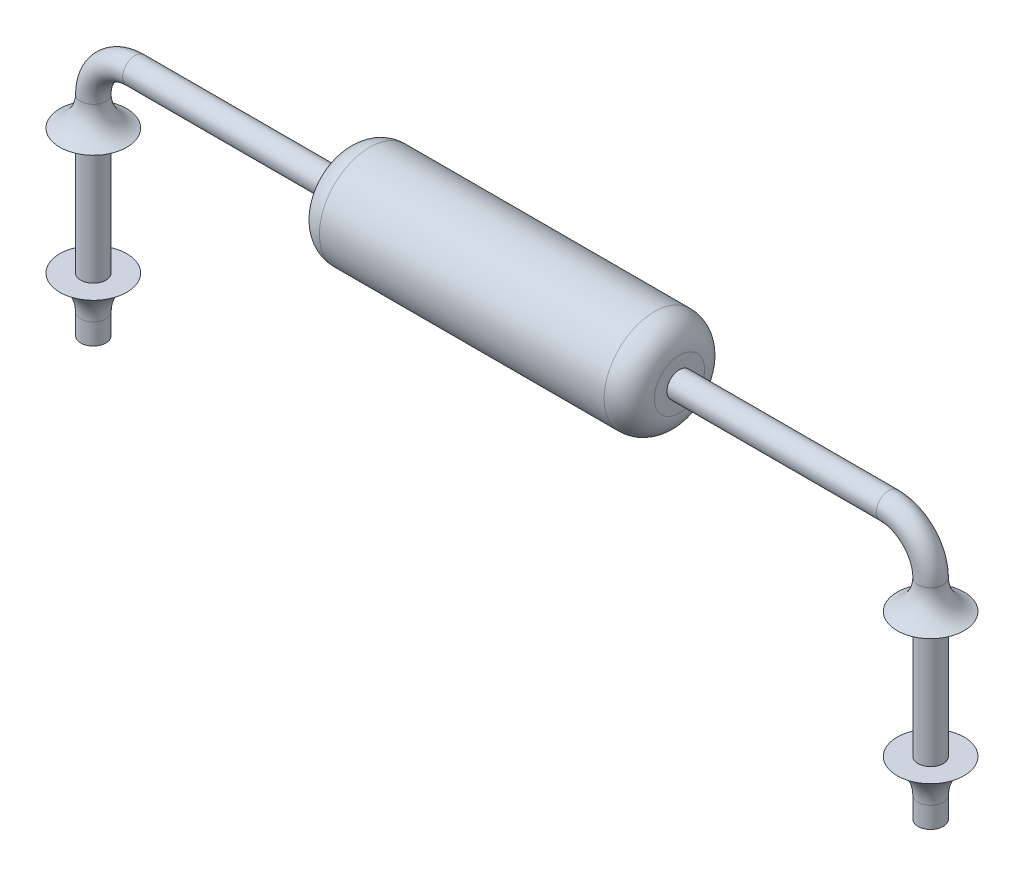
ISO-10303-21;
HEADER;
FILE_DESCRIPTION(('STEP AP214'),'2;1');
FILE_NAME('part.step','',(''),(''),'','','');
FILE_SCHEMA(('AUTOMOTIVE_DESIGN { 1 0 10303 214 1 1 1 1 }'));
ENDSEC;
DATA;
#1=APPLICATION_CONTEXT('core data for automotive mechanical design processes');
#2=APPLICATION_PROTOCOL_DEFINITION('international standard','automotive_design',2000,#1);
#3=PRODUCT_CONTEXT('',#1,'mechanical');
#4=PRODUCT('Part','Part','',(#3));
#5=PRODUCT_RELATED_PRODUCT_CATEGORY('part','',(#4));
#6=PRODUCT_DEFINITION_FORMATION('','',#4);
#7=PRODUCT_DEFINITION_CONTEXT('part definition',#1,'design');
#8=PRODUCT_DEFINITION('design','',#6,#7);
#9=PRODUCT_DEFINITION_SHAPE('','',#8);
#10=(LENGTH_UNIT() NAMED_UNIT(*) SI_UNIT(.MILLI.,.METRE.));
#11=(NAMED_UNIT(*) PLANE_ANGLE_UNIT() SI_UNIT($,.RADIAN.));
#12=(NAMED_UNIT(*) SI_UNIT($,.STERADIAN.) SOLID_ANGLE_UNIT());
#13=UNCERTAINTY_MEASURE_WITH_UNIT(LENGTH_MEASURE(1.E-05),#10,'distance_accuracy_value','');
#14=(GEOMETRIC_REPRESENTATION_CONTEXT(3) GLOBAL_UNCERTAINTY_ASSIGNED_CONTEXT((#13)) GLOBAL_UNIT_ASSIGNED_CONTEXT((#10,
#11,#12)) REPRESENTATION_CONTEXT('',''));
#15=CARTESIAN_POINT('',(0.,0.,0.));
#16=DIRECTION('',(0.,0.,1.));
#17=DIRECTION('',(1.,0.,0.));
#18=AXIS2_PLACEMENT_3D('',#15,#16,#17);
#19=CARTESIAN_POINT('',(5.,-0.5,0.));
#20=DIRECTION('',(0.,-1.,0.));
#21=DIRECTION('',(1.,0.,0.));
#22=AXIS2_PLACEMENT_3D('',#19,#20,#21);
#23=CYLINDRICAL_SURFACE('',#22,0.15);
#24=CARTESIAN_POINT('',(5.,-0.850000000000001,0.));
#25=DIRECTION('',(0.,1.,0.));
#26=DIRECTION('',(-1.,0.,0.));
#27=AXIS2_PLACEMENT_3D('',#24,#25,#26);
#28=CIRCLE('',#27,0.15);
#29=CARTESIAN_POINT('',(4.85,-0.850000000000001,0.));
#30=VERTEX_POINT('',#29);
#31=EDGE_CURVE('E45',#30,#30,#28,.T.);
#32=ORIENTED_EDGE('',*,*,#31,.F.);
#33=EDGE_LOOP('',(#32));
#34=FACE_BOUND('',#33,.T.);
#35=CARTESIAN_POINT('',(5.,-2.35,0.));
#36=DIRECTION('',(0.,-1.,0.));
#37=DIRECTION('',(1.,0.,0.));
#38=AXIS2_PLACEMENT_3D('',#35,#36,#37);
#39=CIRCLE('',#38,0.15);
#40=CARTESIAN_POINT('',(5.15,-2.35,0.));
#41=VERTEX_POINT('',#40);
#42=EDGE_CURVE('E41',#41,#41,#39,.T.);
#43=ORIENTED_EDGE('',*,*,#42,.F.);
#44=EDGE_LOOP('',(#43));
#45=FACE_BOUND('',#44,.T.);
#46=ADVANCED_FACE('F33',(#34,#45),#23,.T.);
#47=CARTESIAN_POINT('',(-2.,0.3,0.));
#48=DIRECTION('',(-1.,0.,0.));
#49=DIRECTION('',(0.,-1.,0.));
#50=AXIS2_PLACEMENT_3D('',#47,#48,#49);
#51=PLANE('',#50);
#52=CARTESIAN_POINT('',(-2.,0.,0.));
#53=DIRECTION('',(1.,0.,0.));
#54=DIRECTION('',(0.,1.,0.));
#55=AXIS2_PLACEMENT_3D('',#52,#53,#54);
#56=CIRCLE('',#55,0.3);
#57=CARTESIAN_POINT('',(-2.,0.3,0.));
#58=VERTEX_POINT('',#57);
#59=EDGE_CURVE('E134',#58,#58,#56,.T.);
#60=ORIENTED_EDGE('',*,*,#59,.F.);
#61=EDGE_LOOP('',(#60));
#62=FACE_BOUND('',#61,.T.);
#63=CARTESIAN_POINT('',(-2.,0.,0.));
#64=DIRECTION('',(-1.,0.,0.));
#65=DIRECTION('',(0.,-1.,0.));
#66=AXIS2_PLACEMENT_3D('',#63,#64,#65);
#67=CIRCLE('',#66,0.15);
#68=CARTESIAN_POINT('',(-2.,-0.150000000000002,0.));
#69=VERTEX_POINT('',#68);
#70=EDGE_CURVE('E60',#69,#69,#67,.T.);
#71=ORIENTED_EDGE('',*,*,#70,.F.);
#72=EDGE_LOOP('',(#71));
#73=FACE_BOUND('',#72,.T.);
#74=ADVANCED_FACE('F173',(#62,#73),#51,.T.);
#75=CARTESIAN_POINT('',(2.,0.3,0.));
#76=DIRECTION('',(1.,0.,0.));
#77=DIRECTION('',(0.,1.,0.));
#78=AXIS2_PLACEMENT_3D('',#75,#76,#77);
#79=PLANE('',#78);
#80=CARTESIAN_POINT('',(2.,0.,0.));
#81=DIRECTION('',(1.,0.,0.));
#82=DIRECTION('',(0.,1.,0.));
#83=AXIS2_PLACEMENT_3D('',#80,#81,#82);
#84=CIRCLE('',#83,0.3);
#85=CARTESIAN_POINT('',(2.,0.3,0.));
#86=VERTEX_POINT('',#85);
#87=EDGE_CURVE('E119',#86,#86,#84,.T.);
#88=ORIENTED_EDGE('',*,*,#87,.T.);
#89=EDGE_LOOP('',(#88));
#90=FACE_BOUND('',#89,.T.);
#91=CARTESIAN_POINT('',(2.,0.,0.));
#92=DIRECTION('',(1.,0.,0.));
#93=DIRECTION('',(0.,1.,0.));
#94=AXIS2_PLACEMENT_3D('',#91,#92,#93);
#95=CIRCLE('',#94,0.15);
#96=CARTESIAN_POINT('',(2.,0.149999999999998,0.));
#97=VERTEX_POINT('',#96);
#98=EDGE_CURVE('E67',#97,#97,#95,.T.);
#99=ORIENTED_EDGE('',*,*,#98,.F.);
#100=EDGE_LOOP('',(#99));
#101=FACE_BOUND('',#100,.T.);
#102=ADVANCED_FACE('F180',(#90,#101),#79,.T.);
#103=CARTESIAN_POINT('',(-1.7,0.,0.));
#104=DIRECTION('',(1.,0.,0.));
#105=DIRECTION('',(0.,1.,0.));
#106=AXIS2_PLACEMENT_3D('',#103,#104,#105);
#107=TOROIDAL_SURFACE('',#106,0.3,0.3);
#108=ORIENTED_EDGE('',*,*,#59,.T.);
#109=EDGE_LOOP('',(#108));
#110=FACE_BOUND('',#109,.T.);
#111=CARTESIAN_POINT('',(-1.7,0.,0.));
#112=DIRECTION('',(1.,0.,0.));
#113=DIRECTION('',(0.,1.,0.));
#114=AXIS2_PLACEMENT_3D('',#111,#112,#113);
#115=CIRCLE('',#114,0.6);
#116=CARTESIAN_POINT('',(-1.7,0.6,0.));
#117=VERTEX_POINT('',#116);
#118=EDGE_CURVE('E73',#117,#117,#115,.T.);
#119=ORIENTED_EDGE('',*,*,#118,.F.);
#120=EDGE_LOOP('',(#119));
#121=FACE_BOUND('',#120,.T.);
#122=ADVANCED_FACE('F333',(#110,#121),#107,.T.);
#123=CARTESIAN_POINT('',(2.,0.,0.));
#124=DIRECTION('',(1.,0.,0.));
#125=DIRECTION('',(0.,1.,0.));
#126=AXIS2_PLACEMENT_3D('',#123,#124,#125);
#127=CYLINDRICAL_SURFACE('',#126,0.6);
#128=ORIENTED_EDGE('',*,*,#118,.T.);
#129=EDGE_LOOP('',(#128));
#130=FACE_BOUND('',#129,.T.);
#131=CARTESIAN_POINT('',(1.7,0.,0.));
#132=DIRECTION('',(1.,0.,0.));
#133=DIRECTION('',(0.,1.,0.));
#134=AXIS2_PLACEMENT_3D('',#131,#132,#133);
#135=CIRCLE('',#134,0.6);
#136=CARTESIAN_POINT('',(1.7,0.6,0.));
#137=VERTEX_POINT('',#136);
#138=EDGE_CURVE('E116',#137,#137,#135,.T.);
#139=ORIENTED_EDGE('',*,*,#138,.F.);
#140=EDGE_LOOP('',(#139));
#141=FACE_BOUND('',#140,.T.);
#142=ADVANCED_FACE('F343',(#130,#141),#127,.T.);
#143=CARTESIAN_POINT('',(1.7,0.,0.));
#144=DIRECTION('',(1.,0.,0.));
#145=DIRECTION('',(0.,1.,0.));
#146=AXIS2_PLACEMENT_3D('',#143,#144,#145);
#147=DEGENERATE_TOROIDAL_SURFACE('',#146,0.3,0.3,.T.);
#148=ORIENTED_EDGE('',*,*,#138,.T.);
#149=EDGE_LOOP('',(#148));
#150=FACE_BOUND('',#149,.T.);
#151=ORIENTED_EDGE('',*,*,#87,.F.);
#152=EDGE_LOOP('',(#151));
#153=FACE_BOUND('',#152,.T.);
#154=ADVANCED_FACE('F246',(#150,#153),#147,.T.);
#155=CARTESIAN_POINT('',(-4.5,-0.5,0.));
#156=DIRECTION('',(0.,0.,-1.));
#157=DIRECTION('',(-1.,0.,0.));
#158=AXIS2_PLACEMENT_3D('',#155,#156,#157);
#159=TOROIDAL_SURFACE('',#158,0.499999999999998,0.15);
#160=CARTESIAN_POINT('',(-5.,-0.499999999999999,0.));
#161=DIRECTION('',(0.,-1.,0.));
#162=DIRECTION('',(0.,0.,-1.));
#163=AXIS2_PLACEMENT_3D('',#160,#161,#162);
#164=CIRCLE('',#163,0.15);
#165=CARTESIAN_POINT('',(-5.15,-0.499999999999999,0.));
#166=VERTEX_POINT('',#165);
#167=EDGE_CURVE('E63',#166,#166,#164,.T.);
#168=CARTESIAN_POINT('',(-4.5,0.,0.));
#169=DIRECTION('',(-1.,0.,0.));
#170=DIRECTION('',(0.,0.,-1.));
#171=AXIS2_PLACEMENT_3D('',#168,#169,#170);
#172=CIRCLE('',#171,0.15);
#173=CARTESIAN_POINT('',(-4.5,0.149999999999998,0.));
#174=VERTEX_POINT('',#173);
#175=EDGE_CURVE('E109',#174,#174,#172,.T.);
#176=CARTESIAN_POINT('',(-4.5,-0.5,0.));
#177=DIRECTION('',(0.,0.,-1.));
#178=DIRECTION('',(-1.,0.,0.));
#179=AXIS2_PLACEMENT_3D('',#176,#177,#178);
#180=CIRCLE('',#179,0.649999999999998);
#181=EDGE_CURVE('',#166,#174,#180,.T.);
#182=ORIENTED_EDGE('',*,*,#167,.F.);
#183=ORIENTED_EDGE('',*,*,#175,.T.);
#184=ORIENTED_EDGE('',*,*,#181,.T.);
#185=ORIENTED_EDGE('',*,*,#181,.F.);
#186=EDGE_LOOP('',(#182,#184,#183,#185));
#187=FACE_BOUND('',#186,.T.);
#188=ADVANCED_FACE('F242',(#187),#159,.T.);
#189=CARTESIAN_POINT('',(-4.5,0.,0.));
#190=DIRECTION('',(1.,0.,0.));
#191=DIRECTION('',(0.,1.,0.));
#192=AXIS2_PLACEMENT_3D('',#189,#190,#191);
#193=CYLINDRICAL_SURFACE('',#192,0.15);
#194=ORIENTED_EDGE('',*,*,#70,.T.);
#195=EDGE_LOOP('',(#194));
#196=FACE_BOUND('',#195,.T.);
#197=ORIENTED_EDGE('',*,*,#175,.F.);
#198=EDGE_LOOP('',(#197));
#199=FACE_BOUND('',#198,.T.);
#200=ADVANCED_FACE('F245',(#196,#199),#193,.T.);
#201=CARTESIAN_POINT('',(4.5,-0.5,0.));
#202=DIRECTION('',(0.,0.,-1.));
#203=DIRECTION('',(-1.,0.,0.));
#204=AXIS2_PLACEMENT_3D('',#201,#202,#203);
#205=TOROIDAL_SURFACE('',#204,0.499999999999997,0.15);
#206=CARTESIAN_POINT('',(4.5,0.,0.));
#207=DIRECTION('',(-1.,0.,0.));
#208=DIRECTION('',(0.,0.,-1.));
#209=AXIS2_PLACEMENT_3D('',#206,#207,#208);
#210=CIRCLE('',#209,0.15);
#211=CARTESIAN_POINT('',(4.5,0.149999999999998,0.));
#212=VERTEX_POINT('',#211);
#213=EDGE_CURVE('E106',#212,#212,#210,.T.);
#214=CARTESIAN_POINT('',(5.,-0.5,0.));
#215=DIRECTION('',(0.,1.,0.));
#216=DIRECTION('',(0.,0.,-1.));
#217=AXIS2_PLACEMENT_3D('',#214,#215,#216);
#218=CIRCLE('',#217,0.15);
#219=CARTESIAN_POINT('',(5.15,-0.500000000000001,0.));
#220=VERTEX_POINT('',#219);
#221=EDGE_CURVE('E101',#220,#220,#218,.T.);
#222=CARTESIAN_POINT('',(4.5,-0.5,0.));
#223=DIRECTION('',(0.,0.,-1.));
#224=DIRECTION('',(-1.,0.,0.));
#225=AXIS2_PLACEMENT_3D('',#222,#223,#224);
#226=CIRCLE('',#225,0.649999999999997);
#227=EDGE_CURVE('',#212,#220,#226,.T.);
#228=ORIENTED_EDGE('',*,*,#213,.F.);
#229=ORIENTED_EDGE('',*,*,#221,.T.);
#230=ORIENTED_EDGE('',*,*,#227,.T.);
#231=ORIENTED_EDGE('',*,*,#227,.F.);
#232=EDGE_LOOP('',(#228,#230,#229,#231));
#233=FACE_BOUND('',#232,.T.);
#234=ADVANCED_FACE('F251',(#233),#205,.T.);
#235=ORIENTED_EDGE('',*,*,#98,.T.);
#236=EDGE_LOOP('',(#235));
#237=FACE_BOUND('',#236,.T.);
#238=ORIENTED_EDGE('',*,*,#213,.T.);
#239=EDGE_LOOP('',(#238));
#240=FACE_BOUND('',#239,.T.);
#241=ADVANCED_FACE('F239',(#237,#240),#193,.T.);
#242=CARTESIAN_POINT('',(-5.,-0.499999999999999,0.));
#243=DIRECTION('',(0.,1.,0.));
#244=DIRECTION('',(0.,0.,1.));
#245=AXIS2_PLACEMENT_3D('',#242,#243,#244);
#246=TOROIDAL_SURFACE('',#245,0.520000000000002,0.370000000000002);
#247=CARTESIAN_POINT('',(-5.,-0.850000000000001,0.));
#248=DIRECTION('',(0.,1.,0.));
#249=DIRECTION('',(0.,0.,1.));
#250=AXIS2_PLACEMENT_3D('',#247,#248,#249);
#251=CIRCLE('',#250,0.4);
#252=CARTESIAN_POINT('',(-5.,-0.850000000000001,0.4));
#253=VERTEX_POINT('',#252);
#254=EDGE_CURVE('E59',#253,#253,#251,.T.);
#255=ORIENTED_EDGE('',*,*,#254,.T.);
#256=EDGE_LOOP('',(#255));
#257=FACE_BOUND('',#256,.T.);
#258=ORIENTED_EDGE('',*,*,#167,.T.);
#259=EDGE_LOOP('',(#258));
#260=FACE_BOUND('',#259,.T.);
#261=ADVANCED_FACE('F233',(#257,#260),#246,.F.);
#262=CARTESIAN_POINT('',(-5.15,-0.85,0.));
#263=DIRECTION('',(0.,-1.,0.));
#264=DIRECTION('',(0.,0.,-1.));
#265=AXIS2_PLACEMENT_3D('',#262,#263,#264);
#266=PLANE('',#265);
#267=CARTESIAN_POINT('',(-5.,-0.85,0.));
#268=DIRECTION('',(0.,1.,0.));
#269=DIRECTION('',(0.,0.,1.));
#270=AXIS2_PLACEMENT_3D('',#267,#268,#269);
#271=CIRCLE('',#270,0.15);
#272=CARTESIAN_POINT('',(-5.,-0.85,0.15));
#273=VERTEX_POINT('',#272);
#274=EDGE_CURVE('E141',#273,#273,#271,.T.);
#275=ORIENTED_EDGE('',*,*,#274,.T.);
#276=EDGE_LOOP('',(#275));
#277=FACE_BOUND('',#276,.T.);
#278=ORIENTED_EDGE('',*,*,#254,.F.);
#279=EDGE_LOOP('',(#278));
#280=FACE_BOUND('',#279,.T.);
#281=ADVANCED_FACE('F228',(#277,#280),#266,.T.);
#282=CARTESIAN_POINT('',(-5.,-6.5,0.));
#283=DIRECTION('',(0.,1.,0.));
#284=DIRECTION('',(-1.,0.,0.));
#285=AXIS2_PLACEMENT_3D('',#282,#283,#284);
#286=CYLINDRICAL_SURFACE('',#285,0.15);
#287=CARTESIAN_POINT('',(-5.,-2.35,0.));
#288=DIRECTION('',(0.,1.,0.));
#289=DIRECTION('',(0.,0.,1.));
#290=AXIS2_PLACEMENT_3D('',#287,#288,#289);
#291=CIRCLE('',#290,0.15);
#292=CARTESIAN_POINT('',(-5.,-2.35,0.15));
#293=VERTEX_POINT('',#292);
#294=EDGE_CURVE('E144',#293,#293,#291,.T.);
#295=ORIENTED_EDGE('',*,*,#294,.T.);
#296=EDGE_LOOP('',(#295));
#297=FACE_BOUND('',#296,.T.);
#298=ORIENTED_EDGE('',*,*,#274,.F.);
#299=EDGE_LOOP('',(#298));
#300=FACE_BOUND('',#299,.T.);
#301=ADVANCED_FACE('F211',(#297,#300),#286,.T.);
#302=CARTESIAN_POINT('',(-5.15,-2.35,0.));
#303=DIRECTION('',(0.,1.,0.));
#304=DIRECTION('',(0.,0.,1.));
#305=AXIS2_PLACEMENT_3D('',#302,#303,#304);
#306=PLANE('',#305);
#307=CARTESIAN_POINT('',(-5.,-2.35,0.));
#308=DIRECTION('',(0.,1.,0.));
#309=DIRECTION('',(0.,0.,1.));
#310=AXIS2_PLACEMENT_3D('',#307,#308,#309);
#311=CIRCLE('',#310,0.4);
#312=CARTESIAN_POINT('',(-5.,-2.35,0.4));
#313=VERTEX_POINT('',#312);
#314=EDGE_CURVE('E147',#313,#313,#311,.T.);
#315=ORIENTED_EDGE('',*,*,#314,.T.);
#316=EDGE_LOOP('',(#315));
#317=FACE_BOUND('',#316,.T.);
#318=ORIENTED_EDGE('',*,*,#294,.F.);
#319=EDGE_LOOP('',(#318));
#320=FACE_BOUND('',#319,.T.);
#321=ADVANCED_FACE('F212',(#317,#320),#306,.T.);
#322=CARTESIAN_POINT('',(-5.,-2.75,0.));
#323=DIRECTION('',(0.,1.,0.));
#324=DIRECTION('',(0.,0.,1.));
#325=AXIS2_PLACEMENT_3D('',#322,#323,#324);
#326=TOROIDAL_SURFACE('',#325,0.594999999999996,0.444999999999997);
#327=CARTESIAN_POINT('',(-5.,-2.75,0.));
#328=DIRECTION('',(0.,1.,0.));
#329=DIRECTION('',(-1.,0.,0.));
#330=AXIS2_PLACEMENT_3D('',#327,#328,#329);
#331=CIRCLE('',#330,0.15);
#332=CARTESIAN_POINT('',(-5.15,-2.75,0.));
#333=VERTEX_POINT('',#332);
#334=EDGE_CURVE('E49',#333,#333,#331,.T.);
#335=ORIENTED_EDGE('',*,*,#334,.T.);
#336=EDGE_LOOP('',(#335));
#337=FACE_BOUND('',#336,.T.);
#338=ORIENTED_EDGE('',*,*,#314,.F.);
#339=EDGE_LOOP('',(#338));
#340=FACE_BOUND('',#339,.T.);
#341=ADVANCED_FACE('F203',(#337,#340),#326,.F.);
#342=CARTESIAN_POINT('',(-6.,-3.,-0.6));
#343=DIRECTION('',(0.,1.,0.));
#344=DIRECTION('',(0.,0.,1.));
#345=AXIS2_PLACEMENT_3D('',#342,#343,#344);
#346=PLANE('',#345);
#347=CARTESIAN_POINT('',(-5.,-3.,0.));
#348=DIRECTION('',(0.,1.,0.));
#349=DIRECTION('',(0.,0.,1.));
#350=AXIS2_PLACEMENT_3D('',#347,#348,#349);
#351=CIRCLE('',#350,0.15);
#352=CARTESIAN_POINT('',(-5.,-3.,0.15));
#353=VERTEX_POINT('',#352);
#354=EDGE_CURVE('E58',#353,#353,#351,.T.);
#355=ORIENTED_EDGE('',*,*,#354,.F.);
#356=EDGE_LOOP('',(#355));
#357=FACE_BOUND('',#356,.T.);
#358=ADVANCED_FACE('F195',(#357),#346,.F.);
#359=ORIENTED_EDGE('',*,*,#354,.T.);
#360=EDGE_LOOP('',(#359));
#361=FACE_BOUND('',#360,.T.);
#362=ORIENTED_EDGE('',*,*,#334,.F.);
#363=EDGE_LOOP('',(#362));
#364=FACE_BOUND('',#363,.T.);
#365=ADVANCED_FACE('F202',(#361,#364),#286,.T.);
#366=CARTESIAN_POINT('',(5.,-0.500000000000002,0.));
#367=DIRECTION('',(0.,1.,0.));
#368=DIRECTION('',(-1.,0.,0.));
#369=AXIS2_PLACEMENT_3D('',#366,#367,#368);
#370=TOROIDAL_SURFACE('',#369,0.519999999999998,0.369999999999998);
#371=ORIENTED_EDGE('',*,*,#221,.F.);
#372=EDGE_LOOP('',(#371));
#373=FACE_BOUND('',#372,.T.);
#374=CARTESIAN_POINT('',(5.,-0.850000000000001,0.));
#375=DIRECTION('',(0.,1.,0.));
#376=DIRECTION('',(-1.,0.,0.));
#377=AXIS2_PLACEMENT_3D('',#374,#375,#376);
#378=CIRCLE('',#377,0.400000000000001);
#379=CARTESIAN_POINT('',(4.6,-0.850000000000001,0.));
#380=VERTEX_POINT('',#379);
#381=EDGE_CURVE('E150',#380,#380,#378,.T.);
#382=ORIENTED_EDGE('',*,*,#381,.T.);
#383=EDGE_LOOP('',(#382));
#384=FACE_BOUND('',#383,.T.);
#385=ADVANCED_FACE('F169',(#373,#384),#370,.F.);
#386=CARTESIAN_POINT('',(5.15,-0.850000000000001,0.));
#387=DIRECTION('',(0.,1.,0.));
#388=DIRECTION('',(-1.,0.,0.));
#389=AXIS2_PLACEMENT_3D('',#386,#387,#388);
#390=PLANE('',#389);
#391=ORIENTED_EDGE('',*,*,#381,.F.);
#392=EDGE_LOOP('',(#391));
#393=FACE_BOUND('',#392,.T.);
#394=ORIENTED_EDGE('',*,*,#31,.T.);
#395=EDGE_LOOP('',(#394));
#396=FACE_BOUND('',#395,.T.);
#397=ADVANCED_FACE('F161',(#393,#396),#390,.F.);
#398=CARTESIAN_POINT('',(5.,-2.75,0.));
#399=DIRECTION('',(0.,1.,0.));
#400=DIRECTION('',(-1.,0.,0.));
#401=AXIS2_PLACEMENT_3D('',#398,#399,#400);
#402=TOROIDAL_SURFACE('',#401,0.594999999999996,0.444999999999997);
#403=CARTESIAN_POINT('',(5.,-2.35,0.));
#404=DIRECTION('',(0.,1.,0.));
#405=DIRECTION('',(-1.,0.,0.));
#406=AXIS2_PLACEMENT_3D('',#403,#404,#405);
#407=CIRCLE('',#406,0.4);
#408=CARTESIAN_POINT('',(4.6,-2.35,0.));
#409=VERTEX_POINT('',#408);
#410=EDGE_CURVE('E153',#409,#409,#407,.T.);
#411=ORIENTED_EDGE('',*,*,#410,.F.);
#412=EDGE_LOOP('',(#411));
#413=FACE_BOUND('',#412,.T.);
#414=CARTESIAN_POINT('',(5.,-2.75,0.));
#415=DIRECTION('',(0.,-1.,0.));
#416=DIRECTION('',(1.,0.,0.));
#417=AXIS2_PLACEMENT_3D('',#414,#415,#416);
#418=CIRCLE('',#417,0.15);
#419=CARTESIAN_POINT('',(5.15,-2.75,0.));
#420=VERTEX_POINT('',#419);
#421=EDGE_CURVE('E10',#420,#420,#418,.F.);
#422=ORIENTED_EDGE('',*,*,#421,.T.);
#423=EDGE_LOOP('',(#422));
#424=FACE_BOUND('',#423,.T.);
#425=ADVANCED_FACE('F159',(#413,#424),#402,.F.);
#426=CARTESIAN_POINT('',(5.15,-2.35,0.));
#427=DIRECTION('',(0.,-1.,0.));
#428=DIRECTION('',(1.,0.,0.));
#429=AXIS2_PLACEMENT_3D('',#426,#427,#428);
#430=PLANE('',#429);
#431=ORIENTED_EDGE('',*,*,#42,.T.);
#432=EDGE_LOOP('',(#431));
#433=FACE_BOUND('',#432,.T.);
#434=ORIENTED_EDGE('',*,*,#410,.T.);
#435=EDGE_LOOP('',(#434));
#436=FACE_BOUND('',#435,.T.);
#437=ADVANCED_FACE('F157',(#433,#436),#430,.F.);
#438=CARTESIAN_POINT('',(5.,-3.,0.));
#439=DIRECTION('',(0.,1.,0.));
#440=DIRECTION('',(0.,0.,1.));
#441=AXIS2_PLACEMENT_3D('',#438,#439,#440);
#442=CIRCLE('',#441,0.15);
#443=CARTESIAN_POINT('',(5.,-3.,0.15));
#444=VERTEX_POINT('',#443);
#445=EDGE_CURVE('E55',#444,#444,#442,.T.);
#446=ORIENTED_EDGE('',*,*,#445,.F.);
#447=EDGE_LOOP('',(#446));
#448=FACE_BOUND('',#447,.T.);
#449=ADVANCED_FACE('F167',(#448),#346,.F.);
#450=ORIENTED_EDGE('',*,*,#445,.T.);
#451=EDGE_LOOP('',(#450));
#452=FACE_BOUND('',#451,.T.);
#453=ORIENTED_EDGE('',*,*,#421,.F.);
#454=EDGE_LOOP('',(#453));
#455=FACE_BOUND('',#454,.T.);
#456=ADVANCED_FACE('F176',(#452,#455),#23,.T.);
#457=CLOSED_SHELL('',(#46,#74,#102,#122,#142,#154,#188,#200,#234,#241,#261,#281,#301,#321,#341,
#358,#365,#385,#397,#425,#437,#449,#456));
#458=CARTESIAN_POINT('',(-1.75,0.35,0.));
#459=DIRECTION('',(1.,0.,0.));
#460=DIRECTION('',(0.,0.,-1.));
#461=AXIS2_PLACEMENT_3D('',#458,#459,#460);
#462=PLANE('',#461);
#463=CARTESIAN_POINT('',(-1.75,0.,0.));
#464=DIRECTION('',(1.,0.,0.));
#465=DIRECTION('',(0.,0.,-1.));
#466=AXIS2_PLACEMENT_3D('',#463,#464,#465);
#467=CIRCLE('',#466,0.25);
#468=CARTESIAN_POINT('',(-1.75,0.,-0.25));
#469=VERTEX_POINT('',#468);
#470=EDGE_CURVE('E92',#469,#469,#467,.F.);
#471=ORIENTED_EDGE('',*,*,#470,.T.);
#472=EDGE_LOOP('',(#471));
#473=FACE_BOUND('',#472,.T.);
#474=CARTESIAN_POINT('',(-1.75,0.,0.));
#475=DIRECTION('',(1.,0.,0.));
#476=DIRECTION('',(0.,0.,-1.));
#477=AXIS2_PLACEMENT_3D('',#474,#475,#476);
#478=CIRCLE('',#477,0.15);
#479=CARTESIAN_POINT('',(-1.75,0.,-0.15));
#480=VERTEX_POINT('',#479);
#481=EDGE_CURVE('E54',#480,#480,#478,.F.);
#482=ORIENTED_EDGE('',*,*,#481,.F.);
#483=EDGE_LOOP('',(#482));
#484=FACE_BOUND('',#483,.T.);
#485=ADVANCED_FACE('F276',(#473,#484),#462,.F.);
#486=CARTESIAN_POINT('',(1.75,0.35,0.));
#487=DIRECTION('',(-1.,0.,0.));
#488=DIRECTION('',(0.,0.,1.));
#489=AXIS2_PLACEMENT_3D('',#486,#487,#488);
#490=PLANE('',#489);
#491=CARTESIAN_POINT('',(1.75,0.,0.));
#492=DIRECTION('',(-1.,0.,0.));
#493=DIRECTION('',(0.,0.,1.));
#494=AXIS2_PLACEMENT_3D('',#491,#492,#493);
#495=CIRCLE('',#494,0.25);
#496=CARTESIAN_POINT('',(1.75,0.,0.25));
#497=VERTEX_POINT('',#496);
#498=EDGE_CURVE('E83',#497,#497,#495,.F.);
#499=ORIENTED_EDGE('',*,*,#498,.T.);
#500=EDGE_LOOP('',(#499));
#501=FACE_BOUND('',#500,.T.);
#502=CARTESIAN_POINT('',(1.75,0.,0.));
#503=DIRECTION('',(-1.,0.,0.));
#504=DIRECTION('',(0.,0.,1.));
#505=AXIS2_PLACEMENT_3D('',#502,#503,#504);
#506=CIRCLE('',#505,0.15);
#507=CARTESIAN_POINT('',(1.75,0.,0.15));
#508=VERTEX_POINT('',#507);
#509=EDGE_CURVE('E74',#508,#508,#506,.F.);
#510=ORIENTED_EDGE('',*,*,#509,.F.);
#511=EDGE_LOOP('',(#510));
#512=FACE_BOUND('',#511,.T.);
#513=ADVANCED_FACE('F277',(#501,#512),#490,.F.);
#514=CARTESIAN_POINT('',(-19.9518482490272,0.,0.));
#515=DIRECTION('',(-1.,0.,0.));
#516=DIRECTION('',(0.,0.,1.));
#517=AXIS2_PLACEMENT_3D('',#514,#515,#516);
#518=CYLINDRICAL_SURFACE('',#517,0.35);
#519=CARTESIAN_POINT('',(-1.65,0.,0.));
#520=DIRECTION('',(1.,0.,0.));
#521=DIRECTION('',(0.,0.,-1.));
#522=AXIS2_PLACEMENT_3D('',#519,#520,#521);
#523=CIRCLE('',#522,0.35);
#524=CARTESIAN_POINT('',(-1.65,0.,-0.35));
#525=VERTEX_POINT('',#524);
#526=EDGE_CURVE('E86',#525,#525,#523,.T.);
#527=ORIENTED_EDGE('',*,*,#526,.T.);
#528=EDGE_LOOP('',(#527));
#529=FACE_BOUND('',#528,.T.);
#530=CARTESIAN_POINT('',(0.150000000000001,0.,0.));
#531=DIRECTION('',(1.,0.,0.));
#532=DIRECTION('',(0.,0.,-1.));
#533=AXIS2_PLACEMENT_3D('',#530,#531,#532);
#534=CIRCLE('',#533,0.35);
#535=CARTESIAN_POINT('',(0.150000000000001,0.,-0.35));
#536=VERTEX_POINT('',#535);
#537=EDGE_CURVE('E77',#536,#536,#534,.T.);
#538=ORIENTED_EDGE('',*,*,#537,.F.);
#539=EDGE_LOOP('',(#538));
#540=FACE_BOUND('',#539,.T.);
#541=ADVANCED_FACE('F274',(#529,#540),#518,.T.);
#542=CARTESIAN_POINT('',(-1.65,0.,0.));
#543=DIRECTION('',(1.,0.,0.));
#544=DIRECTION('',(0.,0.,-1.));
#545=AXIS2_PLACEMENT_3D('',#542,#543,#544);
#546=TOROIDAL_SURFACE('',#545,0.25,0.1);
#547=ORIENTED_EDGE('',*,*,#526,.F.);
#548=EDGE_LOOP('',(#547));
#549=FACE_BOUND('',#548,.T.);
#550=ORIENTED_EDGE('',*,*,#470,.F.);
#551=EDGE_LOOP('',(#550));
#552=FACE_BOUND('',#551,.T.);
#553=ADVANCED_FACE('F286',(#549,#552),#546,.T.);
#554=CARTESIAN_POINT('',(0.150000000000001,0.,0.));
#555=DIRECTION('',(1.,0.,0.));
#556=DIRECTION('',(0.,0.,-1.));
#557=AXIS2_PLACEMENT_3D('',#554,#555,#556);
#558=PLANE('',#557);
#559=CARTESIAN_POINT('',(0.15,0.,0.));
#560=DIRECTION('',(-1.,0.,0.));
#561=DIRECTION('',(0.,0.,1.));
#562=AXIS2_PLACEMENT_3D('',#559,#560,#561);
#563=CIRCLE('',#562,0.55);
#564=CARTESIAN_POINT('',(0.15,0.,0.55));
#565=VERTEX_POINT('',#564);
#566=EDGE_CURVE('E95',#565,#565,#563,.T.);
#567=ORIENTED_EDGE('',*,*,#566,.T.);
#568=EDGE_LOOP('',(#567));
#569=FACE_BOUND('',#568,.T.);
#570=ORIENTED_EDGE('',*,*,#537,.T.);
#571=EDGE_LOOP('',(#570));
#572=FACE_BOUND('',#571,.T.);
#573=ADVANCED_FACE('F288',(#569,#572),#558,.F.);
#574=CARTESIAN_POINT('',(1.25,0.55,0.));
#575=DIRECTION('',(-1.,0.,0.));
#576=DIRECTION('',(0.,0.,1.));
#577=AXIS2_PLACEMENT_3D('',#574,#575,#576);
#578=PLANE('',#577);
#579=CARTESIAN_POINT('',(1.25,0.,0.));
#580=DIRECTION('',(-1.,0.,0.));
#581=DIRECTION('',(0.,0.,1.));
#582=AXIS2_PLACEMENT_3D('',#579,#580,#581);
#583=CIRCLE('',#582,0.55);
#584=CARTESIAN_POINT('',(1.25,0.,0.55));
#585=VERTEX_POINT('',#584);
#586=EDGE_CURVE('E98',#585,#585,#583,.T.);
#587=ORIENTED_EDGE('',*,*,#586,.F.);
#588=EDGE_LOOP('',(#587));
#589=FACE_BOUND('',#588,.T.);
#590=CARTESIAN_POINT('',(1.25,0.,0.));
#591=DIRECTION('',(-1.,0.,0.));
#592=DIRECTION('',(0.,0.,1.));
#593=AXIS2_PLACEMENT_3D('',#590,#591,#592);
#594=CIRCLE('',#593,0.35);
#595=CARTESIAN_POINT('',(1.25,0.,0.35));
#596=VERTEX_POINT('',#595);
#597=EDGE_CURVE('E80',#596,#596,#594,.T.);
#598=ORIENTED_EDGE('',*,*,#597,.T.);
#599=EDGE_LOOP('',(#598));
#600=FACE_BOUND('',#599,.T.);
#601=ADVANCED_FACE('F294',(#589,#600),#578,.F.);
#602=CARTESIAN_POINT('',(0.,0.,0.));
#603=DIRECTION('',(-1.,0.,0.));
#604=DIRECTION('',(0.,0.,1.));
#605=AXIS2_PLACEMENT_3D('',#602,#603,#604);
#606=CYLINDRICAL_SURFACE('',#605,0.55);
#607=ORIENTED_EDGE('',*,*,#566,.F.);
#608=EDGE_LOOP('',(#607));
#609=FACE_BOUND('',#608,.T.);
#610=ORIENTED_EDGE('',*,*,#586,.T.);
#611=EDGE_LOOP('',(#610));
#612=FACE_BOUND('',#611,.T.);
#613=ADVANCED_FACE('F575',(#609,#612),#606,.T.);
#614=CARTESIAN_POINT('',(1.65,0.,0.));
#615=DIRECTION('',(-1.,0.,0.));
#616=DIRECTION('',(0.,0.,1.));
#617=AXIS2_PLACEMENT_3D('',#614,#615,#616);
#618=TOROIDAL_SURFACE('',#617,0.25,0.1);
#619=ORIENTED_EDGE('',*,*,#498,.F.);
#620=EDGE_LOOP('',(#619));
#621=FACE_BOUND('',#620,.T.);
#622=CARTESIAN_POINT('',(1.65,0.,0.));
#623=DIRECTION('',(-1.,0.,0.));
#624=DIRECTION('',(0.,0.,1.));
#625=AXIS2_PLACEMENT_3D('',#622,#623,#624);
#626=CIRCLE('',#625,0.35);
#627=CARTESIAN_POINT('',(1.65,0.,0.35));
#628=VERTEX_POINT('',#627);
#629=EDGE_CURVE('E89',#628,#628,#626,.T.);
#630=ORIENTED_EDGE('',*,*,#629,.F.);
#631=EDGE_LOOP('',(#630));
#632=FACE_BOUND('',#631,.T.);
#633=ADVANCED_FACE('F35',(#621,#632),#618,.T.);
#634=ORIENTED_EDGE('',*,*,#629,.T.);
#635=EDGE_LOOP('',(#634));
#636=FACE_BOUND('',#635,.T.);
#637=ORIENTED_EDGE('',*,*,#597,.F.);
#638=EDGE_LOOP('',(#637));
#639=FACE_BOUND('',#638,.T.);
#640=ADVANCED_FACE('F263',(#636,#639),#518,.T.);
#641=CARTESIAN_POINT('',(-1.955,0.,0.));
#642=DIRECTION('',(1.,0.,0.));
#643=DIRECTION('',(0.,1.,0.));
#644=AXIS2_PLACEMENT_3D('',#641,#642,#643);
#645=CIRCLE('',#644,0.15);
#646=CARTESIAN_POINT('',(-1.955,0.149999999999998,0.));
#647=VERTEX_POINT('',#646);
#648=EDGE_CURVE('E64',#647,#647,#645,.T.);
#649=ORIENTED_EDGE('',*,*,#648,.T.);
#650=EDGE_LOOP('',(#649));
#651=FACE_BOUND('',#650,.T.);
#652=ORIENTED_EDGE('',*,*,#481,.T.);
#653=EDGE_LOOP('',(#652));
#654=FACE_BOUND('',#653,.T.);
#655=ADVANCED_FACE('F254',(#651,#654),#193,.T.);
#656=CARTESIAN_POINT('',(1.955,0.,0.));
#657=DIRECTION('',(-1.,0.,0.));
#658=DIRECTION('',(0.,-1.,0.));
#659=AXIS2_PLACEMENT_3D('',#656,#657,#658);
#660=CIRCLE('',#659,0.15);
#661=CARTESIAN_POINT('',(1.955,-0.150000000000002,0.));
#662=VERTEX_POINT('',#661);
#663=EDGE_CURVE('E70',#662,#662,#660,.T.);
#664=ORIENTED_EDGE('',*,*,#663,.T.);
#665=EDGE_LOOP('',(#664));
#666=FACE_BOUND('',#665,.T.);
#667=ORIENTED_EDGE('',*,*,#509,.T.);
#668=EDGE_LOOP('',(#667));
#669=FACE_BOUND('',#668,.T.);
#670=ADVANCED_FACE('F261',(#666,#669),#193,.T.);
#671=CARTESIAN_POINT('',(-1.955,0.3,0.));
#672=DIRECTION('',(1.,0.,0.));
#673=DIRECTION('',(0.,1.,0.));
#674=AXIS2_PLACEMENT_3D('',#671,#672,#673);
#675=PLANE('',#674);
#676=CARTESIAN_POINT('',(-1.955,0.,0.));
#677=DIRECTION('',(1.,0.,0.));
#678=DIRECTION('',(0.,1.,0.));
#679=AXIS2_PLACEMENT_3D('',#676,#677,#678);
#680=CIRCLE('',#679,0.3);
#681=CARTESIAN_POINT('',(-1.955,0.3,0.));
#682=VERTEX_POINT('',#681);
#683=EDGE_CURVE('E131',#682,#682,#680,.T.);
#684=ORIENTED_EDGE('',*,*,#683,.T.);
#685=EDGE_LOOP('',(#684));
#686=FACE_BOUND('',#685,.T.);
#687=ORIENTED_EDGE('',*,*,#648,.F.);
#688=EDGE_LOOP('',(#687));
#689=FACE_BOUND('',#688,.T.);
#690=ADVANCED_FACE('F270',(#686,#689),#675,.T.);
#691=CARTESIAN_POINT('',(1.955,0.3,0.));
#692=DIRECTION('',(-1.,0.,0.));
#693=DIRECTION('',(0.,-1.,0.));
#694=AXIS2_PLACEMENT_3D('',#691,#692,#693);
#695=PLANE('',#694);
#696=CARTESIAN_POINT('',(1.955,0.,0.));
#697=DIRECTION('',(1.,0.,0.));
#698=DIRECTION('',(0.,1.,0.));
#699=AXIS2_PLACEMENT_3D('',#696,#697,#698);
#700=CIRCLE('',#699,0.3);
#701=CARTESIAN_POINT('',(1.955,0.3,0.));
#702=VERTEX_POINT('',#701);
#703=EDGE_CURVE('E122',#702,#702,#700,.T.);
#704=ORIENTED_EDGE('',*,*,#703,.F.);
#705=EDGE_LOOP('',(#704));
#706=FACE_BOUND('',#705,.T.);
#707=ORIENTED_EDGE('',*,*,#663,.F.);
#708=EDGE_LOOP('',(#707));
#709=FACE_BOUND('',#708,.T.);
#710=ADVANCED_FACE('F392',(#706,#709),#695,.T.);
#711=CARTESIAN_POINT('',(1.7,0.,0.));
#712=DIRECTION('',(1.,0.,0.));
#713=DIRECTION('',(0.,1.,0.));
#714=AXIS2_PLACEMENT_3D('',#711,#712,#713);
#715=TOROIDAL_SURFACE('',#714,0.3,0.255);
#716=ORIENTED_EDGE('',*,*,#703,.T.);
#717=EDGE_LOOP('',(#716));
#718=FACE_BOUND('',#717,.T.);
#719=CARTESIAN_POINT('',(1.7,0.,0.));
#720=DIRECTION('',(1.,0.,0.));
#721=DIRECTION('',(0.,1.,0.));
#722=AXIS2_PLACEMENT_3D('',#719,#720,#721);
#723=CIRCLE('',#722,0.555);
#724=CARTESIAN_POINT('',(1.7,0.555,0.));
#725=VERTEX_POINT('',#724);
#726=EDGE_CURVE('E125',#725,#725,#723,.T.);
#727=ORIENTED_EDGE('',*,*,#726,.F.);
#728=EDGE_LOOP('',(#727));
#729=FACE_BOUND('',#728,.T.);
#730=ADVANCED_FACE('F402',(#718,#729),#715,.F.);
#731=CARTESIAN_POINT('',(2.,0.,0.));
#732=DIRECTION('',(1.,0.,0.));
#733=DIRECTION('',(0.,1.,0.));
#734=AXIS2_PLACEMENT_3D('',#731,#732,#733);
#735=CYLINDRICAL_SURFACE('',#734,0.555);
#736=ORIENTED_EDGE('',*,*,#726,.T.);
#737=EDGE_LOOP('',(#736));
#738=FACE_BOUND('',#737,.T.);
#739=CARTESIAN_POINT('',(-1.7,0.,0.));
#740=DIRECTION('',(1.,0.,0.));
#741=DIRECTION('',(0.,1.,0.));
#742=AXIS2_PLACEMENT_3D('',#739,#740,#741);
#743=CIRCLE('',#742,0.555);
#744=CARTESIAN_POINT('',(-1.7,0.555,0.));
#745=VERTEX_POINT('',#744);
#746=EDGE_CURVE('E128',#745,#745,#743,.T.);
#747=ORIENTED_EDGE('',*,*,#746,.F.);
#748=EDGE_LOOP('',(#747));
#749=FACE_BOUND('',#748,.T.);
#750=ADVANCED_FACE('F412',(#738,#749),#735,.F.);
#751=CARTESIAN_POINT('',(-1.7,0.,0.));
#752=DIRECTION('',(1.,0.,0.));
#753=DIRECTION('',(0.,1.,0.));
#754=AXIS2_PLACEMENT_3D('',#751,#752,#753);
#755=TOROIDAL_SURFACE('',#754,0.3,0.255);
#756=ORIENTED_EDGE('',*,*,#746,.T.);
#757=EDGE_LOOP('',(#756));
#758=FACE_BOUND('',#757,.T.);
#759=ORIENTED_EDGE('',*,*,#683,.F.);
#760=EDGE_LOOP('',(#759));
#761=FACE_BOUND('',#760,.T.);
#762=ADVANCED_FACE('F422',(#758,#761),#755,.F.);
#763=CLOSED_SHELL('',(#485,#513,#541,#553,#573,#601,#613,#633,#640,#655,#670,#690,#710,#730,
#750,#762));
#764=ORIENTED_CLOSED_SHELL('',*,#763,.T.);
#765=BREP_WITH_VOIDS('B2',#457,(#764));
#766=ADVANCED_BREP_SHAPE_REPRESENTATION('',(#18,#765),#14);
#767=SHAPE_DEFINITION_REPRESENTATION(#9,#766);
ENDSEC;
END-ISO-10303-21;
